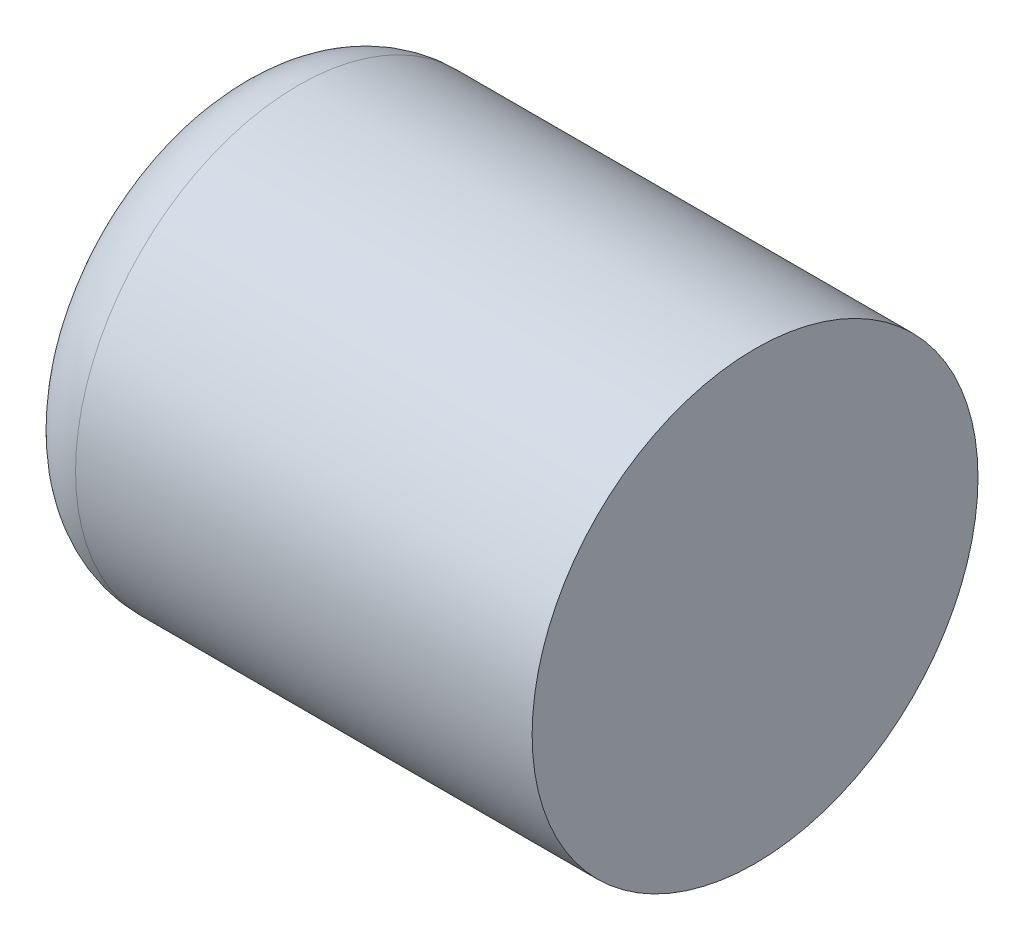
ISO-10303-21;
HEADER;
FILE_DESCRIPTION(('STEP AP214'),'2;1');
FILE_NAME('part.step','',(''),(''),'','','');
FILE_SCHEMA(('AUTOMOTIVE_DESIGN { 1 0 10303 214 1 1 1 1 }'));
ENDSEC;
DATA;
#1=APPLICATION_CONTEXT('core data for automotive mechanical design processes');
#2=APPLICATION_PROTOCOL_DEFINITION('international standard','automotive_design',2000,#1);
#3=PRODUCT_CONTEXT('',#1,'mechanical');
#4=PRODUCT('Part','Part','',(#3));
#5=PRODUCT_RELATED_PRODUCT_CATEGORY('part','',(#4));
#6=PRODUCT_DEFINITION_FORMATION('','',#4);
#7=PRODUCT_DEFINITION_CONTEXT('part definition',#1,'design');
#8=PRODUCT_DEFINITION('design','',#6,#7);
#9=PRODUCT_DEFINITION_SHAPE('','',#8);
#10=(LENGTH_UNIT() NAMED_UNIT(*) SI_UNIT(.MILLI.,.METRE.));
#11=(NAMED_UNIT(*) PLANE_ANGLE_UNIT() SI_UNIT($,.RADIAN.));
#12=(NAMED_UNIT(*) SI_UNIT($,.STERADIAN.) SOLID_ANGLE_UNIT());
#13=UNCERTAINTY_MEASURE_WITH_UNIT(LENGTH_MEASURE(1.E-05),#10,'distance_accuracy_value','');
#14=(GEOMETRIC_REPRESENTATION_CONTEXT(3) GLOBAL_UNCERTAINTY_ASSIGNED_CONTEXT((#13)) GLOBAL_UNIT_ASSIGNED_CONTEXT((#10,
#11,#12)) REPRESENTATION_CONTEXT('',''));
#15=CARTESIAN_POINT('',(0.,0.,0.));
#16=DIRECTION('',(0.,0.,1.));
#17=DIRECTION('',(1.,0.,0.));
#18=AXIS2_PLACEMENT_3D('',#15,#16,#17);
#19=CARTESIAN_POINT('',(0.300635714690617,-0.332340218761648,0.1012));
#20=DIRECTION('',(1.,0.,0.));
#21=DIRECTION('',(0.,1.,0.));
#22=AXIS2_PLACEMENT_3D('',#19,#20,#21);
#23=PLANE('',#22);
#24=CARTESIAN_POINT('',(0.300635714690616,-0.332340218761648,0.1012));
#25=DIRECTION('',(1.,0.,0.));
#26=DIRECTION('',(0.,0.,-1.));
#27=AXIS2_PLACEMENT_3D('',#24,#25,#26);
#28=CIRCLE('',#27,0.0212499999999999);
#29=CARTESIAN_POINT('',(0.300635714690616,-0.332340218761648,0.0799500000000001));
#30=VERTEX_POINT('',#29);
#31=CARTESIAN_POINT('',(0.300635714690617,-0.311090218761648,0.1012));
#32=VERTEX_POINT('',#31);
#33=EDGE_CURVE('E35',#30,#32,#28,.T.);
#34=ORIENTED_EDGE('',*,*,#33,.F.);
#35=CARTESIAN_POINT('',(0.300635714690616,-0.332340218761648,0.1012));
#36=DIRECTION('',(1.,0.,0.));
#37=DIRECTION('',(0.,0.,1.));
#38=AXIS2_PLACEMENT_3D('',#35,#36,#37);
#39=CIRCLE('',#38,0.02125);
#40=CARTESIAN_POINT('',(0.300635714690616,-0.332340218761648,0.12245));
#41=VERTEX_POINT('',#40);
#42=EDGE_CURVE('E44',#41,#30,#39,.T.);
#43=ORIENTED_EDGE('',*,*,#42,.F.);
#44=CARTESIAN_POINT('',(0.300635714690616,-0.332340218761648,0.1012));
#45=DIRECTION('',(1.,0.,0.));
#46=DIRECTION('',(0.,1.,0.));
#47=AXIS2_PLACEMENT_3D('',#44,#45,#46);
#48=CIRCLE('',#47,0.02125);
#49=EDGE_CURVE('E42',#32,#41,#48,.T.);
#50=ORIENTED_EDGE('',*,*,#49,.F.);
#51=EDGE_LOOP('',(#34,#43,#50));
#52=FACE_BOUND('',#51,.T.);
#53=ADVANCED_FACE('F17',(#52),#23,.F.);
#54=CARTESIAN_POINT('',(0.310635714690616,-0.332340218761648,0.1012));
#55=DIRECTION('',(1.,0.,0.));
#56=DIRECTION('',(0.,0.,1.));
#57=AXIS2_PLACEMENT_3D('',#54,#55,#56);
#58=TOROIDAL_SURFACE('',#57,0.02125,0.01);
#59=ORIENTED_EDGE('',*,*,#49,.T.);
#60=ORIENTED_EDGE('',*,*,#42,.T.);
#61=ORIENTED_EDGE('',*,*,#33,.T.);
#62=EDGE_LOOP('',(#59,#60,#61));
#63=FACE_BOUND('',#62,.T.);
#64=CARTESIAN_POINT('',(0.310635714690616,-0.332340218761648,0.1012));
#65=DIRECTION('',(1.,0.,0.));
#66=DIRECTION('',(0.,1.,0.));
#67=AXIS2_PLACEMENT_3D('',#64,#65,#66);
#68=CIRCLE('',#67,0.03125);
#69=CARTESIAN_POINT('',(0.310635714690616,-0.301090218761648,0.1012));
#70=VERTEX_POINT('',#69);
#71=EDGE_CURVE('E27',#70,#70,#68,.T.);
#72=ORIENTED_EDGE('',*,*,#71,.F.);
#73=EDGE_LOOP('',(#72));
#74=FACE_BOUND('',#73,.T.);
#75=ADVANCED_FACE('F49',(#63,#74),#58,.T.);
#76=CARTESIAN_POINT('',(0.374635714690617,-0.332340218761648,0.1012));
#77=DIRECTION('',(-1.,0.,0.));
#78=DIRECTION('',(0.,-1.,0.));
#79=AXIS2_PLACEMENT_3D('',#76,#77,#78);
#80=PLANE('',#79);
#81=CARTESIAN_POINT('',(0.374635714690617,-0.332340218761648,0.1012));
#82=DIRECTION('',(1.,0.,0.));
#83=DIRECTION('',(0.,1.,0.));
#84=AXIS2_PLACEMENT_3D('',#81,#82,#83);
#85=CIRCLE('',#84,0.03125);
#86=CARTESIAN_POINT('',(0.374635714690617,-0.301090218761648,0.1012));
#87=VERTEX_POINT('',#86);
#88=EDGE_CURVE('E11',#87,#87,#85,.F.);
#89=ORIENTED_EDGE('',*,*,#88,.F.);
#90=EDGE_LOOP('',(#89));
#91=FACE_BOUND('',#90,.T.);
#92=ADVANCED_FACE('F65',(#91),#80,.F.);
#93=CARTESIAN_POINT('',(0.404635714690617,-0.332340218761648,0.1012));
#94=DIRECTION('',(1.,0.,0.));
#95=DIRECTION('',(0.,1.,0.));
#96=AXIS2_PLACEMENT_3D('',#93,#94,#95);
#97=CYLINDRICAL_SURFACE('',#96,0.03125);
#98=ORIENTED_EDGE('',*,*,#71,.T.);
#99=EDGE_LOOP('',(#98));
#100=FACE_BOUND('',#99,.T.);
#101=ORIENTED_EDGE('',*,*,#88,.T.);
#102=EDGE_LOOP('',(#101));
#103=FACE_BOUND('',#102,.T.);
#104=ADVANCED_FACE('F89',(#100,#103),#97,.T.);
#105=CLOSED_SHELL('',(#53,#75,#92,#104));
#106=MANIFOLD_SOLID_BREP('B1',#105);
#107=ADVANCED_BREP_SHAPE_REPRESENTATION('',(#18,#106),#14);
#108=SHAPE_DEFINITION_REPRESENTATION(#9,#107);
ENDSEC;
END-ISO-10303-21;
